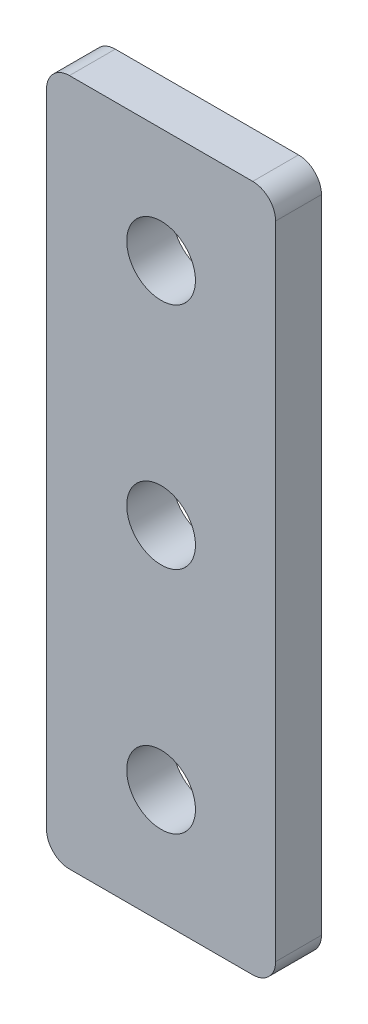
ISO-10303-21;
HEADER;
FILE_DESCRIPTION(('STEP AP214'),'2;1');
FILE_NAME('part.step','',(''),(''),'','','');
FILE_SCHEMA(('AUTOMOTIVE_DESIGN { 1 0 10303 214 1 1 1 1 }'));
ENDSEC;
DATA;
#1=APPLICATION_CONTEXT('core data for automotive mechanical design processes');
#2=APPLICATION_PROTOCOL_DEFINITION('international standard','automotive_design',2000,#1);
#3=PRODUCT_CONTEXT('',#1,'mechanical');
#4=PRODUCT('Part','Part','',(#3));
#5=PRODUCT_RELATED_PRODUCT_CATEGORY('part','',(#4));
#6=PRODUCT_DEFINITION_FORMATION('','',#4);
#7=PRODUCT_DEFINITION_CONTEXT('part definition',#1,'design');
#8=PRODUCT_DEFINITION('design','',#6,#7);
#9=PRODUCT_DEFINITION_SHAPE('','',#8);
#10=(LENGTH_UNIT() NAMED_UNIT(*) SI_UNIT(.MILLI.,.METRE.));
#11=(NAMED_UNIT(*) PLANE_ANGLE_UNIT() SI_UNIT($,.RADIAN.));
#12=(NAMED_UNIT(*) SI_UNIT($,.STERADIAN.) SOLID_ANGLE_UNIT());
#13=UNCERTAINTY_MEASURE_WITH_UNIT(LENGTH_MEASURE(1.E-05),#10,'distance_accuracy_value','');
#14=(GEOMETRIC_REPRESENTATION_CONTEXT(3) GLOBAL_UNCERTAINTY_ASSIGNED_CONTEXT((#13)) GLOBAL_UNIT_ASSIGNED_CONTEXT((#10,
#11,#12)) REPRESENTATION_CONTEXT('',''));
#15=CARTESIAN_POINT('',(0.,0.,0.));
#16=DIRECTION('',(0.,0.,1.));
#17=DIRECTION('',(1.,0.,0.));
#18=AXIS2_PLACEMENT_3D('',#15,#16,#17);
#19=CARTESIAN_POINT('',(0.,0.,2.));
#20=DIRECTION('',(0.,0.,1.));
#21=DIRECTION('',(1.,0.,0.));
#22=AXIS2_PLACEMENT_3D('',#19,#20,#21);
#23=PLANE('',#22);
#24=CARTESIAN_POINT('',(1.64208363104601,-16.909032720238,2.));
#25=DIRECTION('',(0.,0.,1.));
#26=DIRECTION('',(1.,0.,0.));
#27=AXIS2_PLACEMENT_3D('',#24,#25,#26);
#28=CIRCLE('',#27,1.5);
#29=CARTESIAN_POINT('',(3.14208363104601,-16.909032720238,2.));
#30=VERTEX_POINT('',#29);
#31=EDGE_CURVE('E197',#30,#30,#28,.T.);
#32=ORIENTED_EDGE('',*,*,#31,.F.);
#33=EDGE_LOOP('',(#32));
#34=FACE_BOUND('',#33,.T.);
#35=DIRECTION('',(0.,-1.,0.));
#36=VECTOR('',#35,1.);
#37=CARTESIAN_POINT('',(-3.35791636895399,-1.90903272023804,2.));
#38=LINE('',#37,#36);
#39=CARTESIAN_POINT('',(-3.35791636895399,-2.90903272023804,2.));
#40=VERTEX_POINT('',#39);
#41=CARTESIAN_POINT('',(-3.35791636895399,-30.909032720238,2.));
#42=VERTEX_POINT('',#41);
#43=EDGE_CURVE('E141',#40,#42,#38,.T.);
#44=ORIENTED_EDGE('',*,*,#43,.T.);
#45=CARTESIAN_POINT('',(-2.35791636895399,-30.909032720238,2.));
#46=DIRECTION('',(0.,0.,1.));
#47=DIRECTION('',(1.,0.,0.));
#48=AXIS2_PLACEMENT_3D('',#45,#46,#47);
#49=CIRCLE('',#48,1.);
#50=CARTESIAN_POINT('',(-2.35791636895399,-31.909032720238,2.));
#51=VERTEX_POINT('',#50);
#52=EDGE_CURVE('E156',#42,#51,#49,.T.);
#53=ORIENTED_EDGE('',*,*,#52,.T.);
#54=DIRECTION('',(1.,0.,0.));
#55=VECTOR('',#54,1.);
#56=CARTESIAN_POINT('',(-3.35791636895399,-31.909032720238,2.));
#57=LINE('',#56,#55);
#58=CARTESIAN_POINT('',(5.64208363104601,-31.909032720238,2.));
#59=VERTEX_POINT('',#58);
#60=EDGE_CURVE('E123',#51,#59,#57,.T.);
#61=ORIENTED_EDGE('',*,*,#60,.T.);
#62=CARTESIAN_POINT('',(5.64208363104601,-30.909032720238,2.));
#63=DIRECTION('',(0.,0.,1.));
#64=DIRECTION('',(1.,0.,0.));
#65=AXIS2_PLACEMENT_3D('',#62,#63,#64);
#66=CIRCLE('',#65,1.);
#67=CARTESIAN_POINT('',(6.64208363104601,-30.909032720238,2.));
#68=VERTEX_POINT('',#67);
#69=EDGE_CURVE('E154',#59,#68,#66,.T.);
#70=ORIENTED_EDGE('',*,*,#69,.T.);
#71=DIRECTION('',(0.,1.,0.));
#72=VECTOR('',#71,1.);
#73=CARTESIAN_POINT('',(6.64208363104601,-1.90903272023804,2.));
#74=LINE('',#73,#72);
#75=CARTESIAN_POINT('',(6.64208363104601,-2.90903272023804,2.));
#76=VERTEX_POINT('',#75);
#77=EDGE_CURVE('E176',#68,#76,#74,.T.);
#78=ORIENTED_EDGE('',*,*,#77,.T.);
#79=CARTESIAN_POINT('',(5.64208363104601,-2.90903272023804,2.));
#80=DIRECTION('',(0.,0.,1.));
#81=DIRECTION('',(1.,0.,0.));
#82=AXIS2_PLACEMENT_3D('',#79,#80,#81);
#83=CIRCLE('',#82,1.);
#84=CARTESIAN_POINT('',(5.64208363104601,-1.90903272023804,2.));
#85=VERTEX_POINT('',#84);
#86=EDGE_CURVE('E58',#76,#85,#83,.T.);
#87=ORIENTED_EDGE('',*,*,#86,.T.);
#88=DIRECTION('',(-1.,0.,0.));
#89=VECTOR('',#88,1.);
#90=CARTESIAN_POINT('',(-3.35791636895399,-1.90903272023804,2.));
#91=LINE('',#90,#89);
#92=CARTESIAN_POINT('',(-2.35791636895399,-1.90903272023804,2.));
#93=VERTEX_POINT('',#92);
#94=EDGE_CURVE('E142',#85,#93,#91,.T.);
#95=ORIENTED_EDGE('',*,*,#94,.T.);
#96=CARTESIAN_POINT('',(-2.35791636895399,-2.90903272023804,2.));
#97=DIRECTION('',(0.,0.,1.));
#98=DIRECTION('',(1.,0.,0.));
#99=AXIS2_PLACEMENT_3D('',#96,#97,#98);
#100=CIRCLE('',#99,1.);
#101=EDGE_CURVE('E152',#93,#40,#100,.T.);
#102=ORIENTED_EDGE('',*,*,#101,.T.);
#103=EDGE_LOOP('',(#44,#53,#61,#70,#78,#87,#95,#102));
#104=FACE_BOUND('',#103,.T.);
#105=CARTESIAN_POINT('',(1.64208363104601,-6.90903272023804,2.));
#106=DIRECTION('',(0.,0.,1.));
#107=DIRECTION('',(1.,0.,0.));
#108=AXIS2_PLACEMENT_3D('',#105,#106,#107);
#109=CIRCLE('',#108,1.5);
#110=CARTESIAN_POINT('',(3.14208363104601,-6.90903272023804,2.));
#111=VERTEX_POINT('',#110);
#112=EDGE_CURVE('E136',#111,#111,#109,.T.);
#113=ORIENTED_EDGE('',*,*,#112,.F.);
#114=EDGE_LOOP('',(#113));
#115=FACE_BOUND('',#114,.T.);
#116=CARTESIAN_POINT('',(1.64208363104601,-26.909032720238,2.));
#117=DIRECTION('',(0.,0.,1.));
#118=DIRECTION('',(1.,0.,0.));
#119=AXIS2_PLACEMENT_3D('',#116,#117,#118);
#120=CIRCLE('',#119,1.5);
#121=CARTESIAN_POINT('',(3.14208363104601,-26.909032720238,2.));
#122=VERTEX_POINT('',#121);
#123=EDGE_CURVE('E191',#122,#122,#120,.T.);
#124=ORIENTED_EDGE('',*,*,#123,.F.);
#125=EDGE_LOOP('',(#124));
#126=FACE_BOUND('',#125,.T.);
#127=ADVANCED_FACE('F38',(#34,#104,#115,#126),#23,.T.);
#128=CARTESIAN_POINT('',(0.,0.,0.));
#129=DIRECTION('',(0.,0.,1.));
#130=DIRECTION('',(1.,0.,0.));
#131=AXIS2_PLACEMENT_3D('',#128,#129,#130);
#132=PLANE('',#131);
#133=DIRECTION('',(1.,0.,0.));
#134=VECTOR('',#133,1.);
#135=CARTESIAN_POINT('',(-3.35791636895399,-31.909032720238,0.));
#136=LINE('',#135,#134);
#137=CARTESIAN_POINT('',(-2.35791636895399,-31.909032720238,0.));
#138=VERTEX_POINT('',#137);
#139=CARTESIAN_POINT('',(5.64208363104601,-31.909032720238,0.));
#140=VERTEX_POINT('',#139);
#141=EDGE_CURVE('E120',#138,#140,#136,.T.);
#142=ORIENTED_EDGE('',*,*,#141,.F.);
#143=CARTESIAN_POINT('',(-2.35791636895399,-30.909032720238,0.));
#144=DIRECTION('',(0.,0.,1.));
#145=DIRECTION('',(1.,0.,0.));
#146=AXIS2_PLACEMENT_3D('',#143,#144,#145);
#147=CIRCLE('',#146,1.);
#148=CARTESIAN_POINT('',(-3.35791636895399,-30.909032720238,0.));
#149=VERTEX_POINT('',#148);
#150=EDGE_CURVE('E103',#138,#149,#147,.F.);
#151=ORIENTED_EDGE('',*,*,#150,.T.);
#152=DIRECTION('',(0.,-1.,0.));
#153=VECTOR('',#152,1.);
#154=CARTESIAN_POINT('',(-3.35791636895399,-1.90903272023804,0.));
#155=LINE('',#154,#153);
#156=CARTESIAN_POINT('',(-3.35791636895399,-2.90903272023804,0.));
#157=VERTEX_POINT('',#156);
#158=EDGE_CURVE('E131',#157,#149,#155,.T.);
#159=ORIENTED_EDGE('',*,*,#158,.F.);
#160=CARTESIAN_POINT('',(-2.35791636895399,-2.90903272023804,0.));
#161=DIRECTION('',(0.,0.,1.));
#162=DIRECTION('',(1.,0.,0.));
#163=AXIS2_PLACEMENT_3D('',#160,#161,#162);
#164=CIRCLE('',#163,1.);
#165=CARTESIAN_POINT('',(-2.35791636895399,-1.90903272023804,0.));
#166=VERTEX_POINT('',#165);
#167=EDGE_CURVE('E145',#157,#166,#164,.F.);
#168=ORIENTED_EDGE('',*,*,#167,.T.);
#169=DIRECTION('',(-1.,0.,0.));
#170=VECTOR('',#169,1.);
#171=CARTESIAN_POINT('',(-3.35791636895399,-1.90903272023804,0.));
#172=LINE('',#171,#170);
#173=CARTESIAN_POINT('',(5.64208363104601,-1.90903272023804,0.));
#174=VERTEX_POINT('',#173);
#175=EDGE_CURVE('E134',#174,#166,#172,.T.);
#176=ORIENTED_EDGE('',*,*,#175,.F.);
#177=CARTESIAN_POINT('',(5.64208363104601,-2.90903272023804,0.));
#178=DIRECTION('',(0.,0.,1.));
#179=DIRECTION('',(1.,0.,0.));
#180=AXIS2_PLACEMENT_3D('',#177,#178,#179);
#181=CIRCLE('',#180,1.);
#182=CARTESIAN_POINT('',(6.64208363104601,-2.90903272023804,0.));
#183=VERTEX_POINT('',#182);
#184=EDGE_CURVE('E124',#174,#183,#181,.F.);
#185=ORIENTED_EDGE('',*,*,#184,.T.);
#186=DIRECTION('',(0.,1.,0.));
#187=VECTOR('',#186,1.);
#188=CARTESIAN_POINT('',(6.64208363104601,-1.90903272023804,0.));
#189=LINE('',#188,#187);
#190=CARTESIAN_POINT('',(6.64208363104601,-30.909032720238,0.));
#191=VERTEX_POINT('',#190);
#192=EDGE_CURVE('E130',#191,#183,#189,.T.);
#193=ORIENTED_EDGE('',*,*,#192,.F.);
#194=CARTESIAN_POINT('',(5.64208363104601,-30.909032720238,0.));
#195=DIRECTION('',(0.,0.,1.));
#196=DIRECTION('',(1.,0.,0.));
#197=AXIS2_PLACEMENT_3D('',#194,#195,#196);
#198=CIRCLE('',#197,1.);
#199=EDGE_CURVE('E114',#191,#140,#198,.F.);
#200=ORIENTED_EDGE('',*,*,#199,.T.);
#201=EDGE_LOOP('',(#142,#151,#159,#168,#176,#185,#193,#200));
#202=FACE_BOUND('',#201,.T.);
#203=CARTESIAN_POINT('',(1.64208363104601,-6.90903272023804,0.));
#204=DIRECTION('',(0.,0.,1.));
#205=DIRECTION('',(1.,0.,0.));
#206=AXIS2_PLACEMENT_3D('',#203,#204,#205);
#207=CIRCLE('',#206,1.5);
#208=CARTESIAN_POINT('',(3.14208363104601,-6.90903272023804,0.));
#209=VERTEX_POINT('',#208);
#210=EDGE_CURVE('E179',#209,#209,#207,.T.);
#211=ORIENTED_EDGE('',*,*,#210,.T.);
#212=EDGE_LOOP('',(#211));
#213=FACE_BOUND('',#212,.T.);
#214=CARTESIAN_POINT('',(1.64208363104601,-16.909032720238,0.));
#215=DIRECTION('',(0.,0.,1.));
#216=DIRECTION('',(1.,0.,0.));
#217=AXIS2_PLACEMENT_3D('',#214,#215,#216);
#218=CIRCLE('',#217,1.5);
#219=CARTESIAN_POINT('',(3.14208363104601,-16.909032720238,0.));
#220=VERTEX_POINT('',#219);
#221=EDGE_CURVE('E193',#220,#220,#218,.T.);
#222=ORIENTED_EDGE('',*,*,#221,.T.);
#223=EDGE_LOOP('',(#222));
#224=FACE_BOUND('',#223,.T.);
#225=CARTESIAN_POINT('',(1.64208363104601,-26.909032720238,0.));
#226=DIRECTION('',(0.,0.,1.));
#227=DIRECTION('',(1.,0.,0.));
#228=AXIS2_PLACEMENT_3D('',#225,#226,#227);
#229=CIRCLE('',#228,1.5);
#230=CARTESIAN_POINT('',(3.14208363104601,-26.909032720238,0.));
#231=VERTEX_POINT('',#230);
#232=EDGE_CURVE('E194',#231,#231,#229,.T.);
#233=ORIENTED_EDGE('',*,*,#232,.T.);
#234=EDGE_LOOP('',(#233));
#235=FACE_BOUND('',#234,.T.);
#236=ADVANCED_FACE('F127',(#202,#213,#224,#235),#132,.F.);
#237=CARTESIAN_POINT('',(-3.35791636895399,-1.90903272023804,2.));
#238=DIRECTION('',(1.,0.,0.));
#239=DIRECTION('',(0.,1.,0.));
#240=AXIS2_PLACEMENT_3D('',#237,#238,#239);
#241=PLANE('',#240);
#242=ORIENTED_EDGE('',*,*,#158,.T.);
#243=DIRECTION('',(0.,0.,-1.));
#244=VECTOR('',#243,1.);
#245=CARTESIAN_POINT('',(-3.35791636895399,-30.909032720238,2.));
#246=LINE('',#245,#244);
#247=EDGE_CURVE('E108',#149,#42,#246,.F.);
#248=ORIENTED_EDGE('',*,*,#247,.T.);
#249=ORIENTED_EDGE('',*,*,#43,.F.);
#250=DIRECTION('',(0.,0.,-1.));
#251=VECTOR('',#250,1.);
#252=CARTESIAN_POINT('',(-3.35791636895399,-2.90903272023804,2.));
#253=LINE('',#252,#251);
#254=EDGE_CURVE('E113',#40,#157,#253,.T.);
#255=ORIENTED_EDGE('',*,*,#254,.T.);
#256=EDGE_LOOP('',(#242,#248,#249,#255));
#257=FACE_BOUND('',#256,.T.);
#258=ADVANCED_FACE('F173',(#257),#241,.F.);
#259=CARTESIAN_POINT('',(-3.35791636895399,-31.909032720238,2.));
#260=DIRECTION('',(0.,1.,0.));
#261=DIRECTION('',(0.,0.,1.));
#262=AXIS2_PLACEMENT_3D('',#259,#260,#261);
#263=PLANE('',#262);
#264=ORIENTED_EDGE('',*,*,#60,.F.);
#265=DIRECTION('',(0.,0.,-1.));
#266=VECTOR('',#265,1.);
#267=CARTESIAN_POINT('',(-2.35791636895399,-31.909032720238,2.));
#268=LINE('',#267,#266);
#269=EDGE_CURVE('E107',#51,#138,#268,.T.);
#270=ORIENTED_EDGE('',*,*,#269,.T.);
#271=ORIENTED_EDGE('',*,*,#141,.T.);
#272=DIRECTION('',(0.,0.,-1.));
#273=VECTOR('',#272,1.);
#274=CARTESIAN_POINT('',(5.64208363104601,-31.909032720238,2.));
#275=LINE('',#274,#273);
#276=EDGE_CURVE('E125',#140,#59,#275,.F.);
#277=ORIENTED_EDGE('',*,*,#276,.T.);
#278=EDGE_LOOP('',(#264,#270,#271,#277));
#279=FACE_BOUND('',#278,.T.);
#280=ADVANCED_FACE('F119',(#279),#263,.F.);
#281=CARTESIAN_POINT('',(6.64208363104601,-1.90903272023804,2.));
#282=DIRECTION('',(-1.,0.,0.));
#283=DIRECTION('',(0.,-1.,0.));
#284=AXIS2_PLACEMENT_3D('',#281,#282,#283);
#285=PLANE('',#284);
#286=ORIENTED_EDGE('',*,*,#77,.F.);
#287=DIRECTION('',(0.,0.,-1.));
#288=VECTOR('',#287,1.);
#289=CARTESIAN_POINT('',(6.64208363104601,-30.909032720238,2.));
#290=LINE('',#289,#288);
#291=EDGE_CURVE('E160',#68,#191,#290,.T.);
#292=ORIENTED_EDGE('',*,*,#291,.T.);
#293=ORIENTED_EDGE('',*,*,#192,.T.);
#294=DIRECTION('',(0.,0.,-1.));
#295=VECTOR('',#294,1.);
#296=CARTESIAN_POINT('',(6.64208363104601,-2.90903272023804,2.));
#297=LINE('',#296,#295);
#298=EDGE_CURVE('E158',#183,#76,#297,.F.);
#299=ORIENTED_EDGE('',*,*,#298,.T.);
#300=EDGE_LOOP('',(#286,#292,#293,#299));
#301=FACE_BOUND('',#300,.T.);
#302=ADVANCED_FACE('F219',(#301),#285,.F.);
#303=CARTESIAN_POINT('',(-3.35791636895399,-1.90903272023804,2.));
#304=DIRECTION('',(0.,-1.,0.));
#305=DIRECTION('',(0.,0.,-1.));
#306=AXIS2_PLACEMENT_3D('',#303,#304,#305);
#307=PLANE('',#306);
#308=ORIENTED_EDGE('',*,*,#175,.T.);
#309=DIRECTION('',(0.,0.,-1.));
#310=VECTOR('',#309,1.);
#311=CARTESIAN_POINT('',(-2.35791636895399,-1.90903272023804,2.));
#312=LINE('',#311,#310);
#313=EDGE_CURVE('E11',#166,#93,#312,.F.);
#314=ORIENTED_EDGE('',*,*,#313,.T.);
#315=ORIENTED_EDGE('',*,*,#94,.F.);
#316=DIRECTION('',(0.,0.,-1.));
#317=VECTOR('',#316,1.);
#318=CARTESIAN_POINT('',(5.64208363104601,-1.90903272023804,2.));
#319=LINE('',#318,#317);
#320=EDGE_CURVE('E46',#85,#174,#319,.T.);
#321=ORIENTED_EDGE('',*,*,#320,.T.);
#322=EDGE_LOOP('',(#308,#314,#315,#321));
#323=FACE_BOUND('',#322,.T.);
#324=ADVANCED_FACE('F165',(#323),#307,.F.);
#325=CARTESIAN_POINT('',(1.64208363104601,-6.90903272023804,2.));
#326=DIRECTION('',(0.,0.,-1.));
#327=DIRECTION('',(-1.,0.,0.));
#328=AXIS2_PLACEMENT_3D('',#325,#326,#327);
#329=CYLINDRICAL_SURFACE('',#328,1.5);
#330=ORIENTED_EDGE('',*,*,#112,.T.);
#331=EDGE_LOOP('',(#330));
#332=FACE_BOUND('',#331,.T.);
#333=ORIENTED_EDGE('',*,*,#210,.F.);
#334=EDGE_LOOP('',(#333));
#335=FACE_BOUND('',#334,.T.);
#336=ADVANCED_FACE('F208',(#332,#335),#329,.F.);
#337=CARTESIAN_POINT('',(1.64208363104601,-16.909032720238,2.));
#338=DIRECTION('',(0.,0.,-1.));
#339=DIRECTION('',(-1.,0.,0.));
#340=AXIS2_PLACEMENT_3D('',#337,#338,#339);
#341=CYLINDRICAL_SURFACE('',#340,1.5);
#342=ORIENTED_EDGE('',*,*,#31,.T.);
#343=EDGE_LOOP('',(#342));
#344=FACE_BOUND('',#343,.T.);
#345=ORIENTED_EDGE('',*,*,#221,.F.);
#346=EDGE_LOOP('',(#345));
#347=FACE_BOUND('',#346,.T.);
#348=ADVANCED_FACE('F210',(#344,#347),#341,.F.);
#349=CARTESIAN_POINT('',(1.64208363104601,-26.909032720238,2.));
#350=DIRECTION('',(0.,0.,-1.));
#351=DIRECTION('',(-1.,0.,0.));
#352=AXIS2_PLACEMENT_3D('',#349,#350,#351);
#353=CYLINDRICAL_SURFACE('',#352,1.5);
#354=ORIENTED_EDGE('',*,*,#123,.T.);
#355=EDGE_LOOP('',(#354));
#356=FACE_BOUND('',#355,.T.);
#357=ORIENTED_EDGE('',*,*,#232,.F.);
#358=EDGE_LOOP('',(#357));
#359=FACE_BOUND('',#358,.T.);
#360=ADVANCED_FACE('F216',(#356,#359),#353,.F.);
#361=CARTESIAN_POINT('',(-2.35791636895399,-30.909032720238,2.));
#362=DIRECTION('',(0.,0.,-1.));
#363=DIRECTION('',(-1.,0.,0.));
#364=AXIS2_PLACEMENT_3D('',#361,#362,#363);
#365=CYLINDRICAL_SURFACE('',#364,1.);
#366=ORIENTED_EDGE('',*,*,#52,.F.);
#367=ORIENTED_EDGE('',*,*,#247,.F.);
#368=ORIENTED_EDGE('',*,*,#150,.F.);
#369=ORIENTED_EDGE('',*,*,#269,.F.);
#370=EDGE_LOOP('',(#366,#367,#368,#369));
#371=FACE_BOUND('',#370,.T.);
#372=ADVANCED_FACE('F106',(#371),#365,.T.);
#373=CARTESIAN_POINT('',(5.64208363104601,-30.909032720238,2.));
#374=DIRECTION('',(0.,0.,-1.));
#375=DIRECTION('',(-1.,0.,0.));
#376=AXIS2_PLACEMENT_3D('',#373,#374,#375);
#377=CYLINDRICAL_SURFACE('',#376,1.);
#378=ORIENTED_EDGE('',*,*,#69,.F.);
#379=ORIENTED_EDGE('',*,*,#276,.F.);
#380=ORIENTED_EDGE('',*,*,#199,.F.);
#381=ORIENTED_EDGE('',*,*,#291,.F.);
#382=EDGE_LOOP('',(#378,#379,#380,#381));
#383=FACE_BOUND('',#382,.T.);
#384=ADVANCED_FACE('F234',(#383),#377,.T.);
#385=CARTESIAN_POINT('',(-2.35791636895399,-2.90903272023804,2.));
#386=DIRECTION('',(0.,0.,-1.));
#387=DIRECTION('',(-1.,0.,0.));
#388=AXIS2_PLACEMENT_3D('',#385,#386,#387);
#389=CYLINDRICAL_SURFACE('',#388,1.);
#390=ORIENTED_EDGE('',*,*,#101,.F.);
#391=ORIENTED_EDGE('',*,*,#313,.F.);
#392=ORIENTED_EDGE('',*,*,#167,.F.);
#393=ORIENTED_EDGE('',*,*,#254,.F.);
#394=EDGE_LOOP('',(#390,#391,#392,#393));
#395=FACE_BOUND('',#394,.T.);
#396=ADVANCED_FACE('F170',(#395),#389,.T.);
#397=CARTESIAN_POINT('',(5.64208363104601,-2.90903272023804,2.));
#398=DIRECTION('',(0.,0.,-1.));
#399=DIRECTION('',(-1.,0.,0.));
#400=AXIS2_PLACEMENT_3D('',#397,#398,#399);
#401=CYLINDRICAL_SURFACE('',#400,1.);
#402=ORIENTED_EDGE('',*,*,#86,.F.);
#403=ORIENTED_EDGE('',*,*,#298,.F.);
#404=ORIENTED_EDGE('',*,*,#184,.F.);
#405=ORIENTED_EDGE('',*,*,#320,.F.);
#406=EDGE_LOOP('',(#402,#403,#404,#405));
#407=FACE_BOUND('',#406,.T.);
#408=ADVANCED_FACE('F40',(#407),#401,.T.);
#409=CLOSED_SHELL('',(#127,#236,#258,#280,#302,#324,#336,#348,#360,#372,#384,#396,#408));
#410=MANIFOLD_SOLID_BREP('B2',#409);
#411=ADVANCED_BREP_SHAPE_REPRESENTATION('',(#18,#410),#14);
#412=SHAPE_DEFINITION_REPRESENTATION(#9,#411);
ENDSEC;
END-ISO-10303-21;
